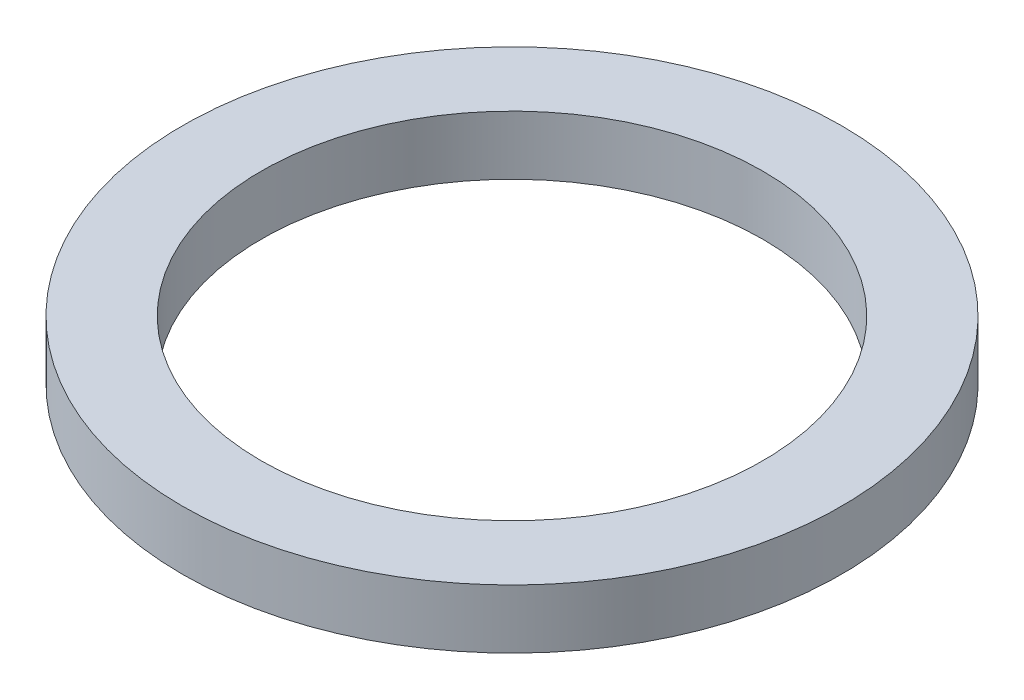
ISO-10303-21;
HEADER;
FILE_DESCRIPTION(('STEP AP214'),'2;1');
FILE_NAME('part.step','',(''),(''),'','','');
FILE_SCHEMA(('AUTOMOTIVE_DESIGN { 1 0 10303 214 1 1 1 1 }'));
ENDSEC;
DATA;
#1=APPLICATION_CONTEXT('core data for automotive mechanical design processes');
#2=APPLICATION_PROTOCOL_DEFINITION('international standard','automotive_design',2000,#1);
#3=PRODUCT_CONTEXT('',#1,'mechanical');
#4=PRODUCT('Part','Part','',(#3));
#5=PRODUCT_RELATED_PRODUCT_CATEGORY('part','',(#4));
#6=PRODUCT_DEFINITION_FORMATION('','',#4);
#7=PRODUCT_DEFINITION_CONTEXT('part definition',#1,'design');
#8=PRODUCT_DEFINITION('design','',#6,#7);
#9=PRODUCT_DEFINITION_SHAPE('','',#8);
#10=(LENGTH_UNIT() NAMED_UNIT(*) SI_UNIT(.MILLI.,.METRE.));
#11=(NAMED_UNIT(*) PLANE_ANGLE_UNIT() SI_UNIT($,.RADIAN.));
#12=(NAMED_UNIT(*) SI_UNIT($,.STERADIAN.) SOLID_ANGLE_UNIT());
#13=UNCERTAINTY_MEASURE_WITH_UNIT(LENGTH_MEASURE(1.E-05),#10,'distance_accuracy_value','');
#14=(GEOMETRIC_REPRESENTATION_CONTEXT(3) GLOBAL_UNCERTAINTY_ASSIGNED_CONTEXT((#13)) GLOBAL_UNIT_ASSIGNED_CONTEXT((#10,
#11,#12)) REPRESENTATION_CONTEXT('',''));
#15=CARTESIAN_POINT('',(0.,0.,0.));
#16=DIRECTION('',(0.,0.,1.));
#17=DIRECTION('',(1.,0.,0.));
#18=AXIS2_PLACEMENT_3D('',#15,#16,#17);
#19=CARTESIAN_POINT('',(0.,0.762,0.));
#20=DIRECTION('',(0.,1.,0.));
#21=DIRECTION('',(0.,0.,1.));
#22=AXIS2_PLACEMENT_3D('',#19,#20,#21);
#23=PLANE('',#22);
#24=CARTESIAN_POINT('',(0.,0.762,0.));
#25=DIRECTION('',(0.,1.,0.));
#26=DIRECTION('',(0.,0.,1.));
#27=AXIS2_PLACEMENT_3D('',#24,#25,#26);
#28=CIRCLE('',#27,4.2545);
#29=CARTESIAN_POINT('',(0.,0.762,4.2545));
#30=VERTEX_POINT('',#29);
#31=EDGE_CURVE('E10',#30,#30,#28,.T.);
#32=ORIENTED_EDGE('',*,*,#31,.T.);
#33=EDGE_LOOP('',(#32));
#34=FACE_BOUND('',#33,.T.);
#35=CARTESIAN_POINT('',(0.,0.762,0.));
#36=DIRECTION('',(0.,1.,0.));
#37=DIRECTION('',(0.,0.,1.));
#38=AXIS2_PLACEMENT_3D('',#35,#36,#37);
#39=CIRCLE('',#38,3.2385);
#40=CARTESIAN_POINT('',(0.,0.762,3.2385));
#41=VERTEX_POINT('',#40);
#42=EDGE_CURVE('E50',#41,#41,#39,.T.);
#43=ORIENTED_EDGE('',*,*,#42,.F.);
#44=EDGE_LOOP('',(#43));
#45=FACE_BOUND('',#44,.T.);
#46=ADVANCED_FACE('F37',(#34,#45),#23,.T.);
#47=CARTESIAN_POINT('',(0.,0.,0.));
#48=DIRECTION('',(0.,1.,0.));
#49=DIRECTION('',(0.,0.,1.));
#50=AXIS2_PLACEMENT_3D('',#47,#48,#49);
#51=PLANE('',#50);
#52=CARTESIAN_POINT('',(0.,0.,0.));
#53=DIRECTION('',(0.,1.,0.));
#54=DIRECTION('',(0.,0.,1.));
#55=AXIS2_PLACEMENT_3D('',#52,#53,#54);
#56=CIRCLE('',#55,4.2545);
#57=CARTESIAN_POINT('',(0.,0.,4.2545));
#58=VERTEX_POINT('',#57);
#59=EDGE_CURVE('E41',#58,#58,#56,.T.);
#60=ORIENTED_EDGE('',*,*,#59,.F.);
#61=EDGE_LOOP('',(#60));
#62=FACE_BOUND('',#61,.T.);
#63=CARTESIAN_POINT('',(0.,0.,0.));
#64=DIRECTION('',(0.,1.,0.));
#65=DIRECTION('',(0.,0.,1.));
#66=AXIS2_PLACEMENT_3D('',#63,#64,#65);
#67=CIRCLE('',#66,3.2385);
#68=CARTESIAN_POINT('',(0.,0.,3.2385));
#69=VERTEX_POINT('',#68);
#70=EDGE_CURVE('E52',#69,#69,#67,.T.);
#71=ORIENTED_EDGE('',*,*,#70,.T.);
#72=EDGE_LOOP('',(#71));
#73=FACE_BOUND('',#72,.T.);
#74=ADVANCED_FACE('F64',(#62,#73),#51,.F.);
#75=CARTESIAN_POINT('',(0.,0.762,0.));
#76=DIRECTION('',(0.,-1.,0.));
#77=DIRECTION('',(0.,0.,-1.));
#78=AXIS2_PLACEMENT_3D('',#75,#76,#77);
#79=CYLINDRICAL_SURFACE('',#78,4.2545);
#80=ORIENTED_EDGE('',*,*,#31,.F.);
#81=EDGE_LOOP('',(#80));
#82=FACE_BOUND('',#81,.T.);
#83=ORIENTED_EDGE('',*,*,#59,.T.);
#84=EDGE_LOOP('',(#83));
#85=FACE_BOUND('',#84,.T.);
#86=ADVANCED_FACE('F39',(#82,#85),#79,.T.);
#87=CARTESIAN_POINT('',(0.,0.762,0.));
#88=DIRECTION('',(0.,-1.,0.));
#89=DIRECTION('',(0.,0.,-1.));
#90=AXIS2_PLACEMENT_3D('',#87,#88,#89);
#91=CYLINDRICAL_SURFACE('',#90,3.2385);
#92=ORIENTED_EDGE('',*,*,#42,.T.);
#93=EDGE_LOOP('',(#92));
#94=FACE_BOUND('',#93,.T.);
#95=ORIENTED_EDGE('',*,*,#70,.F.);
#96=EDGE_LOOP('',(#95));
#97=FACE_BOUND('',#96,.T.);
#98=ADVANCED_FACE('F60',(#94,#97),#91,.F.);
#99=CLOSED_SHELL('',(#46,#74,#86,#98));
#100=MANIFOLD_SOLID_BREP('B2',#99);
#101=ADVANCED_BREP_SHAPE_REPRESENTATION('',(#18,#100),#14);
#102=SHAPE_DEFINITION_REPRESENTATION(#9,#101);
ENDSEC;
END-ISO-10303-21;
